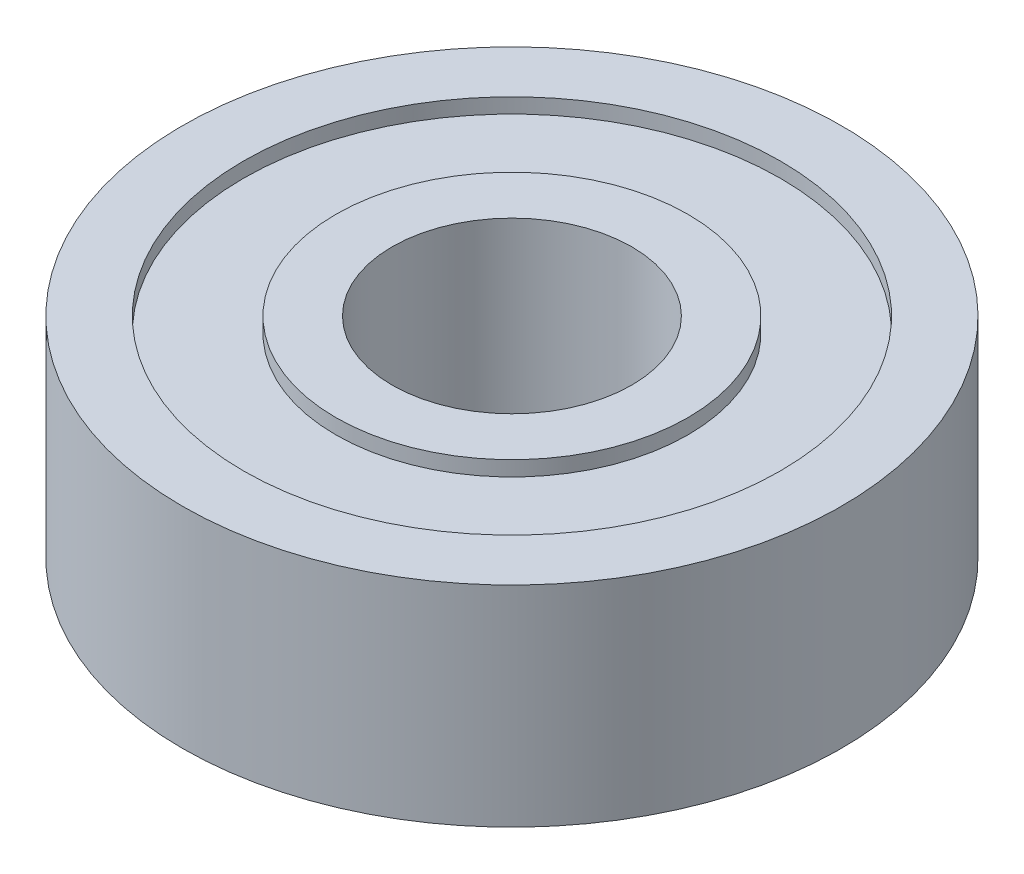
ISO-10303-21;
HEADER;
FILE_DESCRIPTION(('STEP AP214'),'2;1');
FILE_NAME('part.step','',(''),(''),'','','');
FILE_SCHEMA(('AUTOMOTIVE_DESIGN { 1 0 10303 214 1 1 1 1 }'));
ENDSEC;
DATA;
#1=APPLICATION_CONTEXT('core data for automotive mechanical design processes');
#2=APPLICATION_PROTOCOL_DEFINITION('international standard','automotive_design',2000,#1);
#3=PRODUCT_CONTEXT('',#1,'mechanical');
#4=PRODUCT('Part','Part','',(#3));
#5=PRODUCT_RELATED_PRODUCT_CATEGORY('part','',(#4));
#6=PRODUCT_DEFINITION_FORMATION('','',#4);
#7=PRODUCT_DEFINITION_CONTEXT('part definition',#1,'design');
#8=PRODUCT_DEFINITION('design','',#6,#7);
#9=PRODUCT_DEFINITION_SHAPE('','',#8);
#10=(LENGTH_UNIT() NAMED_UNIT(*) SI_UNIT(.MILLI.,.METRE.));
#11=(NAMED_UNIT(*) PLANE_ANGLE_UNIT() SI_UNIT($,.RADIAN.));
#12=(NAMED_UNIT(*) SI_UNIT($,.STERADIAN.) SOLID_ANGLE_UNIT());
#13=UNCERTAINTY_MEASURE_WITH_UNIT(LENGTH_MEASURE(1.E-05),#10,'distance_accuracy_value','');
#14=(GEOMETRIC_REPRESENTATION_CONTEXT(3) GLOBAL_UNCERTAINTY_ASSIGNED_CONTEXT((#13)) GLOBAL_UNIT_ASSIGNED_CONTEXT((#10,
#11,#12)) REPRESENTATION_CONTEXT('',''));
#15=CARTESIAN_POINT('',(0.,0.,0.));
#16=DIRECTION('',(0.,0.,1.));
#17=DIRECTION('',(1.,0.,0.));
#18=AXIS2_PLACEMENT_3D('',#15,#16,#17);
#19=CARTESIAN_POINT('',(0.,0.,0.));
#20=DIRECTION('',(0.,1.,0.));
#21=DIRECTION('',(0.,0.,1.));
#22=AXIS2_PLACEMENT_3D('',#19,#20,#21);
#23=PLANE('',#22);
#24=CARTESIAN_POINT('',(0.,0.,0.));
#25=DIRECTION('',(0.,1.,0.));
#26=DIRECTION('',(0.,0.,1.));
#27=AXIS2_PLACEMENT_3D('',#24,#25,#26);
#28=CIRCLE('',#27,4.);
#29=CARTESIAN_POINT('',(0.,0.,4.));
#30=VERTEX_POINT('',#29);
#31=EDGE_CURVE('E43',#30,#30,#28,.T.);
#32=ORIENTED_EDGE('',*,*,#31,.T.);
#33=EDGE_LOOP('',(#32));
#34=FACE_BOUND('',#33,.T.);
#35=CARTESIAN_POINT('',(0.,0.,0.));
#36=DIRECTION('',(0.,1.,0.));
#37=DIRECTION('',(0.,0.,1.));
#38=AXIS2_PLACEMENT_3D('',#35,#36,#37);
#39=CIRCLE('',#38,5.87662139826249);
#40=CARTESIAN_POINT('',(0.,0.,5.87662139826249));
#41=VERTEX_POINT('',#40);
#42=EDGE_CURVE('E67',#41,#41,#39,.T.);
#43=ORIENTED_EDGE('',*,*,#42,.F.);
#44=EDGE_LOOP('',(#43));
#45=FACE_BOUND('',#44,.T.);
#46=ADVANCED_FACE('F30',(#34,#45),#23,.F.);
#47=CARTESIAN_POINT('',(0.,7.00000000000001,0.));
#48=DIRECTION('',(0.,1.,0.));
#49=DIRECTION('',(0.,0.,1.));
#50=AXIS2_PLACEMENT_3D('',#47,#48,#49);
#51=PLANE('',#50);
#52=CARTESIAN_POINT('',(0.,7.00000000000001,0.));
#53=DIRECTION('',(0.,1.,0.));
#54=DIRECTION('',(0.,0.,1.));
#55=AXIS2_PLACEMENT_3D('',#52,#53,#54);
#56=CIRCLE('',#55,4.);
#57=CARTESIAN_POINT('',(0.,7.00000000000001,4.));
#58=VERTEX_POINT('',#57);
#59=EDGE_CURVE('E41',#58,#58,#56,.T.);
#60=ORIENTED_EDGE('',*,*,#59,.F.);
#61=EDGE_LOOP('',(#60));
#62=FACE_BOUND('',#61,.T.);
#63=CARTESIAN_POINT('',(0.,7.00000000000001,0.));
#64=DIRECTION('',(0.,1.,0.));
#65=DIRECTION('',(0.,0.,1.));
#66=AXIS2_PLACEMENT_3D('',#63,#64,#65);
#67=CIRCLE('',#66,5.87662139826249);
#68=CARTESIAN_POINT('',(0.,7.00000000000001,5.87662139826249));
#69=VERTEX_POINT('',#68);
#70=EDGE_CURVE('E55',#69,#69,#67,.T.);
#71=ORIENTED_EDGE('',*,*,#70,.T.);
#72=EDGE_LOOP('',(#71));
#73=FACE_BOUND('',#72,.T.);
#74=ADVANCED_FACE('F83',(#62,#73),#51,.T.);
#75=CARTESIAN_POINT('',(0.,7.00000000000001,0.));
#76=DIRECTION('',(0.,1.,0.));
#77=DIRECTION('',(0.,0.,1.));
#78=AXIS2_PLACEMENT_3D('',#75,#76,#77);
#79=CIRCLE('',#78,8.95966080481346);
#80=CARTESIAN_POINT('',(0.,7.00000000000001,8.95966080481346));
#81=VERTEX_POINT('',#80);
#82=EDGE_CURVE('E49',#81,#81,#79,.T.);
#83=ORIENTED_EDGE('',*,*,#82,.F.);
#84=EDGE_LOOP('',(#83));
#85=FACE_BOUND('',#84,.T.);
#86=CARTESIAN_POINT('',(0.,7.00000000000001,0.));
#87=DIRECTION('',(0.,1.,0.));
#88=DIRECTION('',(0.,0.,1.));
#89=AXIS2_PLACEMENT_3D('',#86,#87,#88);
#90=CIRCLE('',#89,11.);
#91=CARTESIAN_POINT('',(0.,7.00000000000001,11.));
#92=VERTEX_POINT('',#91);
#93=EDGE_CURVE('E10',#92,#92,#90,.T.);
#94=ORIENTED_EDGE('',*,*,#93,.T.);
#95=EDGE_LOOP('',(#94));
#96=FACE_BOUND('',#95,.T.);
#97=ADVANCED_FACE('F89',(#85,#96),#51,.T.);
#98=CARTESIAN_POINT('',(0.,0.,0.));
#99=DIRECTION('',(0.,1.,0.));
#100=DIRECTION('',(0.,0.,1.));
#101=AXIS2_PLACEMENT_3D('',#98,#99,#100);
#102=CIRCLE('',#101,8.95966080481346);
#103=CARTESIAN_POINT('',(0.,0.,8.95966080481346));
#104=VERTEX_POINT('',#103);
#105=EDGE_CURVE('E61',#104,#104,#102,.T.);
#106=ORIENTED_EDGE('',*,*,#105,.T.);
#107=EDGE_LOOP('',(#106));
#108=FACE_BOUND('',#107,.T.);
#109=CARTESIAN_POINT('',(0.,0.,0.));
#110=DIRECTION('',(0.,1.,0.));
#111=DIRECTION('',(0.,0.,1.));
#112=AXIS2_PLACEMENT_3D('',#109,#110,#111);
#113=CIRCLE('',#112,11.);
#114=CARTESIAN_POINT('',(0.,0.,11.));
#115=VERTEX_POINT('',#114);
#116=EDGE_CURVE('E34',#115,#115,#113,.T.);
#117=ORIENTED_EDGE('',*,*,#116,.F.);
#118=EDGE_LOOP('',(#117));
#119=FACE_BOUND('',#118,.T.);
#120=ADVANCED_FACE('F85',(#108,#119),#23,.F.);
#121=CARTESIAN_POINT('',(0.,7.00000000000001,0.));
#122=DIRECTION('',(0.,-1.,0.));
#123=DIRECTION('',(0.,0.,-1.));
#124=AXIS2_PLACEMENT_3D('',#121,#122,#123);
#125=CYLINDRICAL_SURFACE('',#124,11.);
#126=ORIENTED_EDGE('',*,*,#93,.F.);
#127=EDGE_LOOP('',(#126));
#128=FACE_BOUND('',#127,.T.);
#129=ORIENTED_EDGE('',*,*,#116,.T.);
#130=EDGE_LOOP('',(#129));
#131=FACE_BOUND('',#130,.T.);
#132=ADVANCED_FACE('F32',(#128,#131),#125,.T.);
#133=CARTESIAN_POINT('',(0.,7.00000000000001,0.));
#134=DIRECTION('',(0.,-1.,0.));
#135=DIRECTION('',(0.,0.,-1.));
#136=AXIS2_PLACEMENT_3D('',#133,#134,#135);
#137=CYLINDRICAL_SURFACE('',#136,4.);
#138=ORIENTED_EDGE('',*,*,#59,.T.);
#139=EDGE_LOOP('',(#138));
#140=FACE_BOUND('',#139,.T.);
#141=ORIENTED_EDGE('',*,*,#31,.F.);
#142=EDGE_LOOP('',(#141));
#143=FACE_BOUND('',#142,.T.);
#144=ADVANCED_FACE('F98',(#140,#143),#137,.F.);
#145=CARTESIAN_POINT('',(0.,6.50000000000001,0.));
#146=DIRECTION('',(0.,1.,0.));
#147=DIRECTION('',(0.,0.,1.));
#148=AXIS2_PLACEMENT_3D('',#145,#146,#147);
#149=CYLINDRICAL_SURFACE('',#148,8.95966080481346);
#150=CARTESIAN_POINT('',(0.,6.50000000000001,0.));
#151=DIRECTION('',(0.,1.,0.));
#152=DIRECTION('',(0.,0.,1.));
#153=AXIS2_PLACEMENT_3D('',#150,#151,#152);
#154=CIRCLE('',#153,8.95966080481346);
#155=CARTESIAN_POINT('',(0.,6.50000000000001,8.95966080481346));
#156=VERTEX_POINT('',#155);
#157=EDGE_CURVE('E46',#156,#156,#154,.T.);
#158=ORIENTED_EDGE('',*,*,#157,.F.);
#159=EDGE_LOOP('',(#158));
#160=FACE_BOUND('',#159,.T.);
#161=ORIENTED_EDGE('',*,*,#82,.T.);
#162=EDGE_LOOP('',(#161));
#163=FACE_BOUND('',#162,.T.);
#164=ADVANCED_FACE('F122',(#160,#163),#149,.F.);
#165=CARTESIAN_POINT('',(0.,6.50000000000001,0.));
#166=DIRECTION('',(0.,1.,0.));
#167=DIRECTION('',(0.,0.,1.));
#168=AXIS2_PLACEMENT_3D('',#165,#166,#167);
#169=PLANE('',#168);
#170=CARTESIAN_POINT('',(0.,6.50000000000001,0.));
#171=DIRECTION('',(0.,1.,0.));
#172=DIRECTION('',(0.,0.,1.));
#173=AXIS2_PLACEMENT_3D('',#170,#171,#172);
#174=CIRCLE('',#173,5.87662139826249);
#175=CARTESIAN_POINT('',(0.,6.50000000000001,5.87662139826249));
#176=VERTEX_POINT('',#175);
#177=EDGE_CURVE('E52',#176,#176,#174,.T.);
#178=ORIENTED_EDGE('',*,*,#177,.F.);
#179=EDGE_LOOP('',(#178));
#180=FACE_BOUND('',#179,.T.);
#181=ORIENTED_EDGE('',*,*,#157,.T.);
#182=EDGE_LOOP('',(#181));
#183=FACE_BOUND('',#182,.T.);
#184=ADVANCED_FACE('F118',(#180,#183),#169,.T.);
#185=CARTESIAN_POINT('',(0.,6.50000000000001,0.));
#186=DIRECTION('',(0.,1.,0.));
#187=DIRECTION('',(0.,0.,1.));
#188=AXIS2_PLACEMENT_3D('',#185,#186,#187);
#189=CYLINDRICAL_SURFACE('',#188,5.87662139826249);
#190=ORIENTED_EDGE('',*,*,#177,.T.);
#191=EDGE_LOOP('',(#190));
#192=FACE_BOUND('',#191,.T.);
#193=ORIENTED_EDGE('',*,*,#70,.F.);
#194=EDGE_LOOP('',(#193));
#195=FACE_BOUND('',#194,.T.);
#196=ADVANCED_FACE('F112',(#192,#195),#189,.T.);
#197=CARTESIAN_POINT('',(0.,0.5,0.));
#198=DIRECTION('',(0.,-1.,0.));
#199=DIRECTION('',(0.,0.,1.));
#200=AXIS2_PLACEMENT_3D('',#197,#198,#199);
#201=PLANE('',#200);
#202=CARTESIAN_POINT('',(0.,0.5,0.));
#203=DIRECTION('',(0.,1.,0.));
#204=DIRECTION('',(0.,0.,1.));
#205=AXIS2_PLACEMENT_3D('',#202,#203,#204);
#206=CIRCLE('',#205,8.95966080481346);
#207=CARTESIAN_POINT('',(0.,0.5,8.95966080481346));
#208=VERTEX_POINT('',#207);
#209=EDGE_CURVE('E58',#208,#208,#206,.T.);
#210=ORIENTED_EDGE('',*,*,#209,.F.);
#211=EDGE_LOOP('',(#210));
#212=FACE_BOUND('',#211,.T.);
#213=CARTESIAN_POINT('',(0.,0.5,0.));
#214=DIRECTION('',(0.,1.,0.));
#215=DIRECTION('',(0.,0.,1.));
#216=AXIS2_PLACEMENT_3D('',#213,#214,#215);
#217=CIRCLE('',#216,5.87662139826249);
#218=CARTESIAN_POINT('',(0.,0.5,5.87662139826249));
#219=VERTEX_POINT('',#218);
#220=EDGE_CURVE('E64',#219,#219,#217,.T.);
#221=ORIENTED_EDGE('',*,*,#220,.T.);
#222=EDGE_LOOP('',(#221));
#223=FACE_BOUND('',#222,.T.);
#224=ADVANCED_FACE('F73',(#212,#223),#201,.T.);
#225=CARTESIAN_POINT('',(0.,0.5,0.));
#226=DIRECTION('',(0.,-1.,0.));
#227=DIRECTION('',(0.,0.,-1.));
#228=AXIS2_PLACEMENT_3D('',#225,#226,#227);
#229=CYLINDRICAL_SURFACE('',#228,8.95966080481346);
#230=ORIENTED_EDGE('',*,*,#209,.T.);
#231=EDGE_LOOP('',(#230));
#232=FACE_BOUND('',#231,.T.);
#233=ORIENTED_EDGE('',*,*,#105,.F.);
#234=EDGE_LOOP('',(#233));
#235=FACE_BOUND('',#234,.T.);
#236=ADVANCED_FACE('F78',(#232,#235),#229,.F.);
#237=CARTESIAN_POINT('',(0.,0.5,0.));
#238=DIRECTION('',(0.,-1.,0.));
#239=DIRECTION('',(0.,0.,-1.));
#240=AXIS2_PLACEMENT_3D('',#237,#238,#239);
#241=CYLINDRICAL_SURFACE('',#240,5.87662139826249);
#242=ORIENTED_EDGE('',*,*,#220,.F.);
#243=EDGE_LOOP('',(#242));
#244=FACE_BOUND('',#243,.T.);
#245=ORIENTED_EDGE('',*,*,#42,.T.);
#246=EDGE_LOOP('',(#245));
#247=FACE_BOUND('',#246,.T.);
#248=ADVANCED_FACE('F75',(#244,#247),#241,.T.);
#249=CLOSED_SHELL('',(#46,#74,#97,#120,#132,#144,#164,#184,#196,#224,#236,#248));
#250=MANIFOLD_SOLID_BREP('B2',#249);
#251=ADVANCED_BREP_SHAPE_REPRESENTATION('',(#18,#250),#14);
#252=SHAPE_DEFINITION_REPRESENTATION(#9,#251);
ENDSEC;
END-ISO-10303-21;
